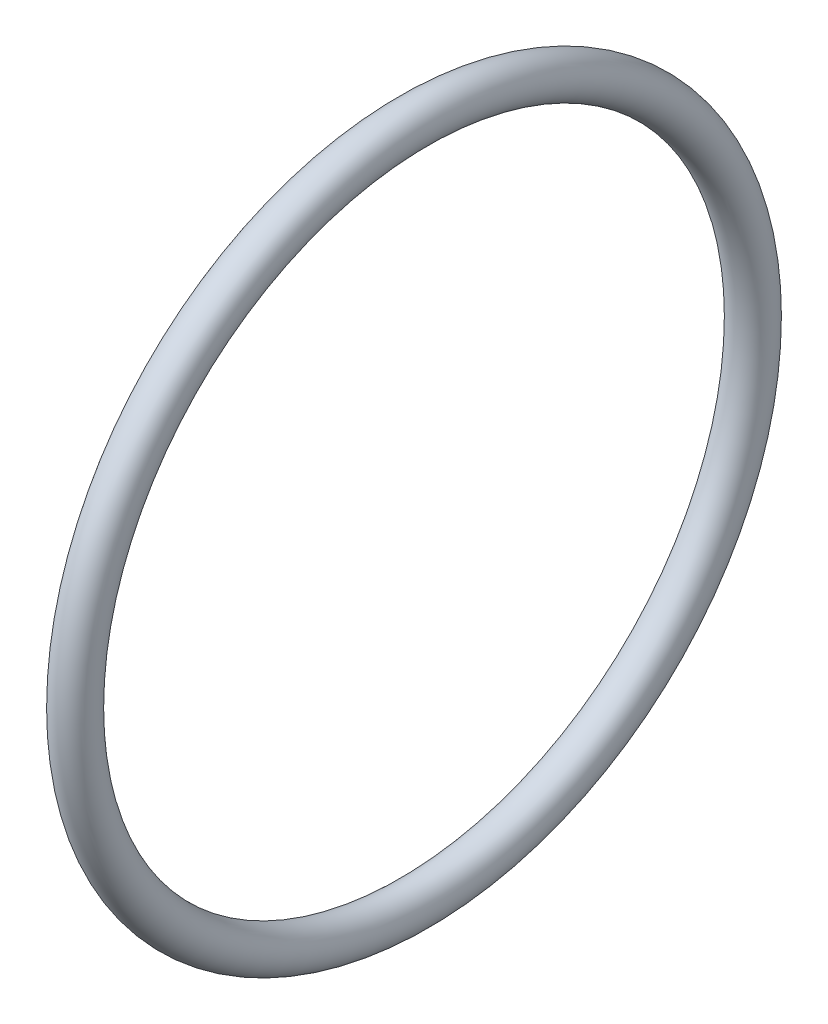
ISO-10303-21;
HEADER;
FILE_DESCRIPTION(('STEP AP214'),'2;1');
FILE_NAME('part.step','',(''),(''),'','','');
FILE_SCHEMA(('AUTOMOTIVE_DESIGN { 1 0 10303 214 1 1 1 1 }'));
ENDSEC;
DATA;
#1=APPLICATION_CONTEXT('core data for automotive mechanical design processes');
#2=APPLICATION_PROTOCOL_DEFINITION('international standard','automotive_design',2000,#1);
#3=PRODUCT_CONTEXT('',#1,'mechanical');
#4=PRODUCT('Part','Part','',(#3));
#5=PRODUCT_RELATED_PRODUCT_CATEGORY('part','',(#4));
#6=PRODUCT_DEFINITION_FORMATION('','',#4);
#7=PRODUCT_DEFINITION_CONTEXT('part definition',#1,'design');
#8=PRODUCT_DEFINITION('design','',#6,#7);
#9=PRODUCT_DEFINITION_SHAPE('','',#8);
#10=(LENGTH_UNIT() NAMED_UNIT(*) SI_UNIT(.MILLI.,.METRE.));
#11=(NAMED_UNIT(*) PLANE_ANGLE_UNIT() SI_UNIT($,.RADIAN.));
#12=(NAMED_UNIT(*) SI_UNIT($,.STERADIAN.) SOLID_ANGLE_UNIT());
#13=UNCERTAINTY_MEASURE_WITH_UNIT(LENGTH_MEASURE(1.E-05),#10,'distance_accuracy_value','');
#14=(GEOMETRIC_REPRESENTATION_CONTEXT(3) GLOBAL_UNCERTAINTY_ASSIGNED_CONTEXT((#13)) GLOBAL_UNIT_ASSIGNED_CONTEXT((#10,
#11,#12)) REPRESENTATION_CONTEXT('',''));
#15=CARTESIAN_POINT('',(0.,0.,0.));
#16=DIRECTION('',(0.,0.,1.));
#17=DIRECTION('',(1.,0.,0.));
#18=AXIS2_PLACEMENT_3D('',#15,#16,#17);
#19=CARTESIAN_POINT('',(21.989799937,0.,0.));
#20=DIRECTION('',(-1.,0.,0.));
#21=DIRECTION('',(0.,0.,1.));
#22=AXIS2_PLACEMENT_3D('',#19,#20,#21);
#23=TOROIDAL_SURFACE('',#22,15.949999977,0.950000004999999);
#24=CARTESIAN_POINT('',(21.989799937,0.,16.899999982));
#25=VERTEX_POINT('',#24);
#26=VERTEX_LOOP('',#25);
#27=FACE_BOUND('',#26,.T.);
#28=ADVANCED_FACE('F33',(#27),#23,.T.);
#29=CLOSED_SHELL('',(#28));
#30=MANIFOLD_SOLID_BREP('B2',#29);
#31=ADVANCED_BREP_SHAPE_REPRESENTATION('',(#18,#30),#14);
#32=SHAPE_DEFINITION_REPRESENTATION(#9,#31);
ENDSEC;
END-ISO-10303-21;
